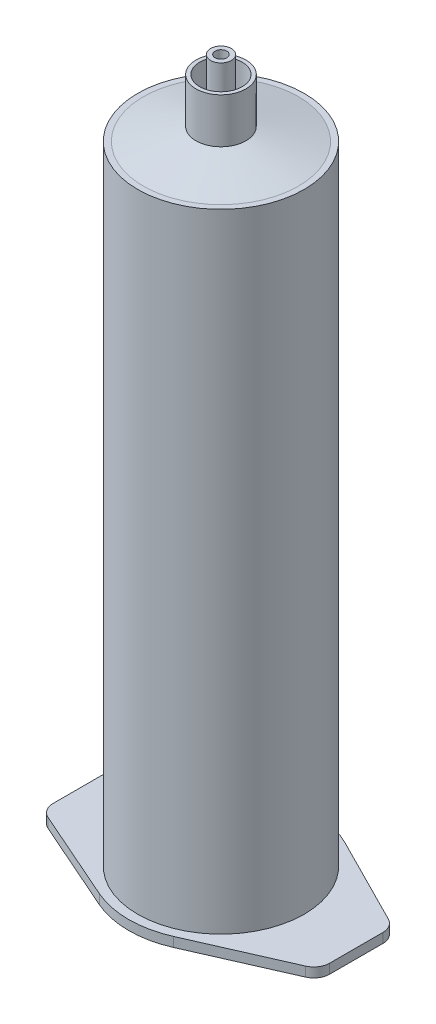
ISO-10303-21;
HEADER;
FILE_DESCRIPTION(('STEP AP214'),'2;1');
FILE_NAME('part.step','',(''),(''),'','','');
FILE_SCHEMA(('AUTOMOTIVE_DESIGN { 1 0 10303 214 1 1 1 1 }'));
ENDSEC;
DATA;
#1=APPLICATION_CONTEXT('core data for automotive mechanical design processes');
#2=APPLICATION_PROTOCOL_DEFINITION('international standard','automotive_design',2000,#1);
#3=PRODUCT_CONTEXT('',#1,'mechanical');
#4=PRODUCT('Part','Part','',(#3));
#5=PRODUCT_RELATED_PRODUCT_CATEGORY('part','',(#4));
#6=PRODUCT_DEFINITION_FORMATION('','',#4);
#7=PRODUCT_DEFINITION_CONTEXT('part definition',#1,'design');
#8=PRODUCT_DEFINITION('design','',#6,#7);
#9=PRODUCT_DEFINITION_SHAPE('','',#8);
#10=(LENGTH_UNIT() NAMED_UNIT(*) SI_UNIT(.MILLI.,.METRE.));
#11=(NAMED_UNIT(*) PLANE_ANGLE_UNIT() SI_UNIT($,.RADIAN.));
#12=(NAMED_UNIT(*) SI_UNIT($,.STERADIAN.) SOLID_ANGLE_UNIT());
#13=UNCERTAINTY_MEASURE_WITH_UNIT(LENGTH_MEASURE(1.E-05),#10,'distance_accuracy_value','');
#14=(GEOMETRIC_REPRESENTATION_CONTEXT(3) GLOBAL_UNCERTAINTY_ASSIGNED_CONTEXT((#13)) GLOBAL_UNIT_ASSIGNED_CONTEXT((#10,
#11,#12)) REPRESENTATION_CONTEXT('',''));
#15=CARTESIAN_POINT('',(0.,0.,0.));
#16=DIRECTION('',(0.,0.,1.));
#17=DIRECTION('',(1.,0.,0.));
#18=AXIS2_PLACEMENT_3D('',#15,#16,#17);
#19=CARTESIAN_POINT('',(-26.,-1.8,0.));
#20=DIRECTION('',(1.,0.,0.));
#21=DIRECTION('',(0.,0.,-1.));
#22=AXIS2_PLACEMENT_3D('',#19,#20,#21);
#23=PLANE('',#22);
#24=DIRECTION('',(0.,0.,-1.));
#25=VECTOR('',#24,1.);
#26=CARTESIAN_POINT('',(-26.,0.,0.));
#27=LINE('',#26,#25);
#28=CARTESIAN_POINT('',(-26.,0.,5.5523228190701));
#29=VERTEX_POINT('',#28);
#30=CARTESIAN_POINT('',(-26.,0.,-4.44630064282572));
#31=VERTEX_POINT('',#30);
#32=EDGE_CURVE('E177',#29,#31,#27,.T.);
#33=ORIENTED_EDGE('',*,*,#32,.T.);
#34=DIRECTION('',(0.,1.,0.));
#35=VECTOR('',#34,1.);
#36=CARTESIAN_POINT('',(-26.,-1.8,-4.44630064282572));
#37=LINE('',#36,#35);
#38=CARTESIAN_POINT('',(-26.,-1.8,-4.44630064282572));
#39=VERTEX_POINT('',#38);
#40=EDGE_CURVE('E13',#39,#31,#37,.T.);
#41=ORIENTED_EDGE('',*,*,#40,.F.);
#42=DIRECTION('',(0.,0.,-1.));
#43=VECTOR('',#42,1.);
#44=CARTESIAN_POINT('',(-26.,-1.8,0.));
#45=LINE('',#44,#43);
#46=CARTESIAN_POINT('',(-26.,-1.8,5.5523228190701));
#47=VERTEX_POINT('',#46);
#48=EDGE_CURVE('E425',#47,#39,#45,.T.);
#49=ORIENTED_EDGE('',*,*,#48,.F.);
#50=DIRECTION('',(0.,1.,0.));
#51=VECTOR('',#50,1.);
#52=CARTESIAN_POINT('',(-26.,-1.8,5.5523228190701));
#53=LINE('',#52,#51);
#54=EDGE_CURVE('E67',#47,#29,#53,.T.);
#55=ORIENTED_EDGE('',*,*,#54,.T.);
#56=EDGE_LOOP('',(#33,#41,#49,#55));
#57=FACE_BOUND('',#56,.T.);
#58=ADVANCED_FACE('F50',(#57),#23,.F.);
#59=CARTESIAN_POINT('',(-23.,-1.8,-4.44630064282574));
#60=DIRECTION('',(0.,1.,0.));
#61=DIRECTION('',(0.,0.,1.));
#62=AXIS2_PLACEMENT_3D('',#59,#60,#61);
#63=CYLINDRICAL_SURFACE('',#62,3.);
#64=CARTESIAN_POINT('',(-23.,0.,-4.44630064282574));
#65=DIRECTION('',(0.,-1.,0.));
#66=DIRECTION('',(0.,0.,-1.));
#67=AXIS2_PLACEMENT_3D('',#64,#65,#66);
#68=CIRCLE('',#67,3.);
#69=CARTESIAN_POINT('',(-24.3542389470097,0.,-7.1232460801483));
#70=VERTEX_POINT('',#69);
#71=EDGE_CURVE('E179',#31,#70,#68,.T.);
#72=ORIENTED_EDGE('',*,*,#71,.T.);
#73=DIRECTION('',(0.,1.,0.));
#74=VECTOR('',#73,1.);
#75=CARTESIAN_POINT('',(-24.3542389470097,-1.8,-7.1232460801483));
#76=LINE('',#75,#74);
#77=CARTESIAN_POINT('',(-24.3542389470097,-1.8,-7.1232460801483));
#78=VERTEX_POINT('',#77);
#79=EDGE_CURVE('E59',#78,#70,#76,.T.);
#80=ORIENTED_EDGE('',*,*,#79,.F.);
#81=CARTESIAN_POINT('',(-23.,-1.8,-4.44630064282574));
#82=DIRECTION('',(0.,-1.,0.));
#83=DIRECTION('',(0.,0.,-1.));
#84=AXIS2_PLACEMENT_3D('',#81,#82,#83);
#85=CIRCLE('',#84,3.);
#86=EDGE_CURVE('E117',#39,#78,#85,.T.);
#87=ORIENTED_EDGE('',*,*,#86,.F.);
#88=ORIENTED_EDGE('',*,*,#40,.T.);
#89=EDGE_LOOP('',(#72,#80,#87,#88));
#90=FACE_BOUND('',#89,.T.);
#91=ADVANCED_FACE('F272',(#90),#63,.T.);
#92=CARTESIAN_POINT('',(-7.83201524353949,-1.8,-15.4816677791821));
#93=DIRECTION('',(0.45141298233657,0.,0.892315145774184));
#94=DIRECTION('',(0.892315145774184,0.,-0.45141298233657));
#95=AXIS2_PLACEMENT_3D('',#92,#93,#94);
#96=PLANE('',#95);
#97=DIRECTION('',(0.892315145774184,0.,-0.45141298233657));
#98=VECTOR('',#97,1.);
#99=CARTESIAN_POINT('',(-7.83201524353949,0.,-15.4816677791821));
#100=LINE('',#99,#98);
#101=CARTESIAN_POINT('',(-7.83201524353949,0.,-15.4816677791821));
#102=VERTEX_POINT('',#101);
#103=EDGE_CURVE('E181',#70,#102,#100,.T.);
#104=ORIENTED_EDGE('',*,*,#103,.T.);
#105=DIRECTION('',(0.,1.,0.));
#106=VECTOR('',#105,1.);
#107=CARTESIAN_POINT('',(-7.83201524353949,-1.8,-15.4816677791821));
#108=LINE('',#107,#106);
#109=CARTESIAN_POINT('',(-7.83201524353949,-1.8,-15.4816677791821));
#110=VERTEX_POINT('',#109);
#111=EDGE_CURVE('E219',#110,#102,#108,.T.);
#112=ORIENTED_EDGE('',*,*,#111,.F.);
#113=DIRECTION('',(0.892315145774184,0.,-0.45141298233657));
#114=VECTOR('',#113,1.);
#115=CARTESIAN_POINT('',(-7.83201524353949,-1.8,-15.4816677791821));
#116=LINE('',#115,#114);
#117=EDGE_CURVE('E227',#78,#110,#116,.T.);
#118=ORIENTED_EDGE('',*,*,#117,.F.);
#119=ORIENTED_EDGE('',*,*,#79,.T.);
#120=EDGE_LOOP('',(#104,#112,#118,#119));
#121=FACE_BOUND('',#120,.T.);
#122=ADVANCED_FACE('F225',(#121),#96,.F.);
#123=CARTESIAN_POINT('',(0.,-1.8,0.));
#124=DIRECTION('',(0.,1.,0.));
#125=DIRECTION('',(0.,0.,1.));
#126=AXIS2_PLACEMENT_3D('',#123,#124,#125);
#127=CYLINDRICAL_SURFACE('',#126,17.35);
#128=CARTESIAN_POINT('',(0.,0.,0.));
#129=DIRECTION('',(0.,-1.,0.));
#130=DIRECTION('',(0.,0.,-1.));
#131=AXIS2_PLACEMENT_3D('',#128,#129,#130);
#132=CIRCLE('',#131,17.35);
#133=CARTESIAN_POINT('',(7.83201524353949,0.,-15.4816677791821));
#134=VERTEX_POINT('',#133);
#135=EDGE_CURVE('E183',#102,#134,#132,.T.);
#136=ORIENTED_EDGE('',*,*,#135,.T.);
#137=DIRECTION('',(0.,1.,0.));
#138=VECTOR('',#137,1.);
#139=CARTESIAN_POINT('',(7.83201524353949,-1.8,-15.4816677791821));
#140=LINE('',#139,#138);
#141=CARTESIAN_POINT('',(7.83201524353949,-1.8,-15.4816677791821));
#142=VERTEX_POINT('',#141);
#143=EDGE_CURVE('E217',#142,#134,#140,.T.);
#144=ORIENTED_EDGE('',*,*,#143,.F.);
#145=CARTESIAN_POINT('',(0.,-1.8,0.));
#146=DIRECTION('',(0.,-1.,0.));
#147=DIRECTION('',(0.,0.,-1.));
#148=AXIS2_PLACEMENT_3D('',#145,#146,#147);
#149=CIRCLE('',#148,17.35);
#150=EDGE_CURVE('E157',#110,#142,#149,.T.);
#151=ORIENTED_EDGE('',*,*,#150,.F.);
#152=ORIENTED_EDGE('',*,*,#111,.T.);
#153=EDGE_LOOP('',(#136,#144,#151,#152));
#154=FACE_BOUND('',#153,.T.);
#155=ADVANCED_FACE('F234',(#154),#127,.T.);
#156=CARTESIAN_POINT('',(7.83201524353949,-1.8,-15.4816677791821));
#157=DIRECTION('',(0.45141298233657,0.,-0.892315145774184));
#158=DIRECTION('',(-0.892315145774184,0.,-0.45141298233657));
#159=AXIS2_PLACEMENT_3D('',#156,#157,#158);
#160=PLANE('',#159);
#161=DIRECTION('',(-0.892315145774184,0.,-0.45141298233657));
#162=VECTOR('',#161,1.);
#163=CARTESIAN_POINT('',(7.83201524353949,0.,-15.4816677791821));
#164=LINE('',#163,#162);
#165=CARTESIAN_POINT('',(24.3542389470097,0.,-7.1232460801483));
#166=VERTEX_POINT('',#165);
#167=EDGE_CURVE('E186',#166,#134,#164,.T.);
#168=ORIENTED_EDGE('',*,*,#167,.F.);
#169=DIRECTION('',(0.,1.,0.));
#170=VECTOR('',#169,1.);
#171=CARTESIAN_POINT('',(24.3542389470097,-1.8,-7.1232460801483));
#172=LINE('',#171,#170);
#173=CARTESIAN_POINT('',(24.3542389470097,-1.8,-7.1232460801483));
#174=VERTEX_POINT('',#173);
#175=EDGE_CURVE('E215',#174,#166,#172,.T.);
#176=ORIENTED_EDGE('',*,*,#175,.F.);
#177=DIRECTION('',(-0.892315145774184,0.,-0.45141298233657));
#178=VECTOR('',#177,1.);
#179=CARTESIAN_POINT('',(7.83201524353949,-1.8,-15.4816677791821));
#180=LINE('',#179,#178);
#181=EDGE_CURVE('E238',#174,#142,#180,.T.);
#182=ORIENTED_EDGE('',*,*,#181,.T.);
#183=ORIENTED_EDGE('',*,*,#143,.T.);
#184=EDGE_LOOP('',(#168,#176,#182,#183));
#185=FACE_BOUND('',#184,.T.);
#186=ADVANCED_FACE('F280',(#185),#160,.T.);
#187=CARTESIAN_POINT('',(23.,-1.8,-4.44630064282574));
#188=DIRECTION('',(0.,1.,0.));
#189=DIRECTION('',(0.,0.,1.));
#190=AXIS2_PLACEMENT_3D('',#187,#188,#189);
#191=CYLINDRICAL_SURFACE('',#190,3.);
#192=CARTESIAN_POINT('',(23.,0.,-4.44630064282574));
#193=DIRECTION('',(0.,-1.,0.));
#194=DIRECTION('',(0.,0.,-1.));
#195=AXIS2_PLACEMENT_3D('',#192,#193,#194);
#196=CIRCLE('',#195,3.);
#197=CARTESIAN_POINT('',(26.,0.,-4.44630064282572));
#198=VERTEX_POINT('',#197);
#199=EDGE_CURVE('E189',#198,#166,#196,.F.);
#200=ORIENTED_EDGE('',*,*,#199,.F.);
#201=DIRECTION('',(0.,1.,0.));
#202=VECTOR('',#201,1.);
#203=CARTESIAN_POINT('',(26.,-1.8,-4.44630064282572));
#204=LINE('',#203,#202);
#205=CARTESIAN_POINT('',(26.,-1.8,-4.44630064282572));
#206=VERTEX_POINT('',#205);
#207=EDGE_CURVE('E213',#206,#198,#204,.T.);
#208=ORIENTED_EDGE('',*,*,#207,.F.);
#209=CARTESIAN_POINT('',(23.,-1.8,-4.44630064282574));
#210=DIRECTION('',(0.,-1.,0.));
#211=DIRECTION('',(0.,0.,-1.));
#212=AXIS2_PLACEMENT_3D('',#209,#210,#211);
#213=CIRCLE('',#212,3.);
#214=EDGE_CURVE('E239',#206,#174,#213,.F.);
#215=ORIENTED_EDGE('',*,*,#214,.T.);
#216=ORIENTED_EDGE('',*,*,#175,.T.);
#217=EDGE_LOOP('',(#200,#208,#215,#216));
#218=FACE_BOUND('',#217,.T.);
#219=ADVANCED_FACE('F283',(#218),#191,.T.);
#220=CARTESIAN_POINT('',(26.,-1.8,0.));
#221=DIRECTION('',(1.,0.,0.));
#222=DIRECTION('',(0.,0.,-1.));
#223=AXIS2_PLACEMENT_3D('',#220,#221,#222);
#224=PLANE('',#223);
#225=DIRECTION('',(0.,0.,-1.));
#226=VECTOR('',#225,1.);
#227=CARTESIAN_POINT('',(26.,0.,0.));
#228=LINE('',#227,#226);
#229=CARTESIAN_POINT('',(26.,0.,5.5523228190701));
#230=VERTEX_POINT('',#229);
#231=EDGE_CURVE('E192',#230,#198,#228,.T.);
#232=ORIENTED_EDGE('',*,*,#231,.F.);
#233=DIRECTION('',(0.,1.,0.));
#234=VECTOR('',#233,1.);
#235=CARTESIAN_POINT('',(26.,-1.8,5.5523228190701));
#236=LINE('',#235,#234);
#237=CARTESIAN_POINT('',(26.,-1.8,5.5523228190701));
#238=VERTEX_POINT('',#237);
#239=EDGE_CURVE('E211',#238,#230,#236,.T.);
#240=ORIENTED_EDGE('',*,*,#239,.F.);
#241=DIRECTION('',(0.,0.,-1.));
#242=VECTOR('',#241,1.);
#243=CARTESIAN_POINT('',(26.,-1.8,0.));
#244=LINE('',#243,#242);
#245=EDGE_CURVE('E246',#238,#206,#244,.T.);
#246=ORIENTED_EDGE('',*,*,#245,.T.);
#247=ORIENTED_EDGE('',*,*,#207,.T.);
#248=EDGE_LOOP('',(#232,#240,#246,#247));
#249=FACE_BOUND('',#248,.T.);
#250=ADVANCED_FACE('F287',(#249),#224,.T.);
#251=CARTESIAN_POINT('',(23.,-1.8,5.55232281907011));
#252=DIRECTION('',(0.,1.,0.));
#253=DIRECTION('',(0.,0.,1.));
#254=AXIS2_PLACEMENT_3D('',#251,#252,#253);
#255=CYLINDRICAL_SURFACE('',#254,3.);
#256=CARTESIAN_POINT('',(23.,0.,5.55232281907011));
#257=DIRECTION('',(0.,-1.,0.));
#258=DIRECTION('',(0.,0.,-1.));
#259=AXIS2_PLACEMENT_3D('',#256,#257,#258);
#260=CIRCLE('',#259,3.);
#261=CARTESIAN_POINT('',(24.2089291094169,0.,8.29795396844258));
#262=VERTEX_POINT('',#261);
#263=EDGE_CURVE('E195',#230,#262,#260,.T.);
#264=ORIENTED_EDGE('',*,*,#263,.T.);
#265=DIRECTION('',(0.,1.,0.));
#266=VECTOR('',#265,1.);
#267=CARTESIAN_POINT('',(24.2089291094169,-1.8,8.29795396844258));
#268=LINE('',#267,#266);
#269=CARTESIAN_POINT('',(24.2089291094169,-1.8,8.29795396844258));
#270=VERTEX_POINT('',#269);
#271=EDGE_CURVE('E208',#270,#262,#268,.T.);
#272=ORIENTED_EDGE('',*,*,#271,.F.);
#273=CARTESIAN_POINT('',(23.,-1.8,5.55232281907011));
#274=DIRECTION('',(0.,-1.,0.));
#275=DIRECTION('',(0.,0.,-1.));
#276=AXIS2_PLACEMENT_3D('',#273,#274,#275);
#277=CIRCLE('',#276,3.);
#278=EDGE_CURVE('E248',#238,#270,#277,.T.);
#279=ORIENTED_EDGE('',*,*,#278,.F.);
#280=ORIENTED_EDGE('',*,*,#239,.T.);
#281=EDGE_LOOP('',(#264,#272,#279,#280));
#282=FACE_BOUND('',#281,.T.);
#283=ADVANCED_FACE('F254',(#282),#255,.T.);
#284=CARTESIAN_POINT('',(6.99164001612796,-1.8,15.8789001472041));
#285=DIRECTION('',(-0.402976369805646,0.,-0.915210383124155));
#286=DIRECTION('',(-0.915210383124156,0.,0.402976369805646));
#287=AXIS2_PLACEMENT_3D('',#284,#285,#286);
#288=PLANE('',#287);
#289=DIRECTION('',(-0.915210383124156,0.,0.402976369805646));
#290=VECTOR('',#289,1.);
#291=CARTESIAN_POINT('',(6.99164001612796,0.,15.8789001472041));
#292=LINE('',#291,#290);
#293=CARTESIAN_POINT('',(6.99164001612796,0.,15.8789001472041));
#294=VERTEX_POINT('',#293);
#295=EDGE_CURVE('E197',#262,#294,#292,.T.);
#296=ORIENTED_EDGE('',*,*,#295,.T.);
#297=DIRECTION('',(0.,1.,0.));
#298=VECTOR('',#297,1.);
#299=CARTESIAN_POINT('',(6.99164001612796,-1.8,15.8789001472041));
#300=LINE('',#299,#298);
#301=CARTESIAN_POINT('',(6.99164001612796,-1.8,15.8789001472041));
#302=VERTEX_POINT('',#301);
#303=EDGE_CURVE('E165',#302,#294,#300,.T.);
#304=ORIENTED_EDGE('',*,*,#303,.F.);
#305=DIRECTION('',(-0.915210383124156,0.,0.402976369805646));
#306=VECTOR('',#305,1.);
#307=CARTESIAN_POINT('',(6.99164001612796,-1.8,15.8789001472041));
#308=LINE('',#307,#306);
#309=EDGE_CURVE('E152',#270,#302,#308,.T.);
#310=ORIENTED_EDGE('',*,*,#309,.F.);
#311=ORIENTED_EDGE('',*,*,#271,.T.);
#312=EDGE_LOOP('',(#296,#304,#310,#311));
#313=FACE_BOUND('',#312,.T.);
#314=ADVANCED_FACE('F258',(#313),#288,.F.);
#315=CARTESIAN_POINT('',(-6.99164001612796,0.,15.8789001472041));
#316=VERTEX_POINT('',#315);
#317=EDGE_CURVE('E162',#294,#316,#132,.T.);
#318=ORIENTED_EDGE('',*,*,#317,.T.);
#319=DIRECTION('',(0.,1.,0.));
#320=VECTOR('',#319,1.);
#321=CARTESIAN_POINT('',(-6.99164001612796,-1.8,15.8789001472041));
#322=LINE('',#321,#320);
#323=CARTESIAN_POINT('',(-6.99164001612796,-1.8,15.8789001472041));
#324=VERTEX_POINT('',#323);
#325=EDGE_CURVE('E159',#324,#316,#322,.T.);
#326=ORIENTED_EDGE('',*,*,#325,.F.);
#327=EDGE_CURVE('E145',#302,#324,#149,.T.);
#328=ORIENTED_EDGE('',*,*,#327,.F.);
#329=ORIENTED_EDGE('',*,*,#303,.T.);
#330=EDGE_LOOP('',(#318,#326,#328,#329));
#331=FACE_BOUND('',#330,.T.);
#332=ADVANCED_FACE('F160',(#331),#127,.T.);
#333=CARTESIAN_POINT('',(-6.99164001612796,-1.8,15.8789001472041));
#334=DIRECTION('',(-0.402976369805646,0.,0.915210383124155));
#335=DIRECTION('',(0.915210383124156,0.,0.402976369805646));
#336=AXIS2_PLACEMENT_3D('',#333,#334,#335);
#337=PLANE('',#336);
#338=DIRECTION('',(0.915210383124156,0.,0.402976369805646));
#339=VECTOR('',#338,1.);
#340=CARTESIAN_POINT('',(-6.99164001612796,0.,15.8789001472041));
#341=LINE('',#340,#339);
#342=CARTESIAN_POINT('',(-24.2089291094169,0.,8.29795396844258));
#343=VERTEX_POINT('',#342);
#344=EDGE_CURVE('E199',#343,#316,#341,.T.);
#345=ORIENTED_EDGE('',*,*,#344,.F.);
#346=DIRECTION('',(0.,1.,0.));
#347=VECTOR('',#346,1.);
#348=CARTESIAN_POINT('',(-24.2089291094169,-1.8,8.29795396844258));
#349=LINE('',#348,#347);
#350=CARTESIAN_POINT('',(-24.2089291094169,-1.8,8.29795396844258));
#351=VERTEX_POINT('',#350);
#352=EDGE_CURVE('E105',#351,#343,#349,.T.);
#353=ORIENTED_EDGE('',*,*,#352,.F.);
#354=DIRECTION('',(0.915210383124156,0.,0.402976369805646));
#355=VECTOR('',#354,1.);
#356=CARTESIAN_POINT('',(-6.99164001612796,-1.8,15.8789001472041));
#357=LINE('',#356,#355);
#358=EDGE_CURVE('E150',#351,#324,#357,.T.);
#359=ORIENTED_EDGE('',*,*,#358,.T.);
#360=ORIENTED_EDGE('',*,*,#325,.T.);
#361=EDGE_LOOP('',(#345,#353,#359,#360));
#362=FACE_BOUND('',#361,.T.);
#363=ADVANCED_FACE('F167',(#362),#337,.T.);
#364=CARTESIAN_POINT('',(0.,-1.8,0.));
#365=DIRECTION('',(0.,1.,0.));
#366=DIRECTION('',(0.,0.,1.));
#367=AXIS2_PLACEMENT_3D('',#364,#365,#366);
#368=CYLINDRICAL_SURFACE('',#367,14.575);
#369=CARTESIAN_POINT('',(0.,-1.8,0.));
#370=DIRECTION('',(0.,-1.,0.));
#371=DIRECTION('',(0.,0.,-1.));
#372=AXIS2_PLACEMENT_3D('',#369,#370,#371);
#373=CIRCLE('',#372,14.575);
#374=CARTESIAN_POINT('',(0.,-1.8,-14.575));
#375=VERTEX_POINT('',#374);
#376=EDGE_CURVE('E204',#375,#375,#373,.F.);
#377=ORIENTED_EDGE('',*,*,#376,.F.);
#378=EDGE_LOOP('',(#377));
#379=FACE_BOUND('',#378,.T.);
#380=CARTESIAN_POINT('',(0.,0.,0.));
#381=DIRECTION('',(0.,-1.,0.));
#382=DIRECTION('',(0.,0.,-1.));
#383=AXIS2_PLACEMENT_3D('',#380,#381,#382);
#384=CIRCLE('',#383,14.575);
#385=CARTESIAN_POINT('',(0.,0.,-14.575));
#386=VERTEX_POINT('',#385);
#387=EDGE_CURVE('E174',#386,#386,#384,.F.);
#388=ORIENTED_EDGE('',*,*,#387,.T.);
#389=EDGE_LOOP('',(#388));
#390=FACE_BOUND('',#389,.T.);
#391=ADVANCED_FACE('F52',(#379,#390),#368,.F.);
#392=CARTESIAN_POINT('',(-23.,-1.8,5.55232281907011));
#393=DIRECTION('',(0.,1.,0.));
#394=DIRECTION('',(0.,0.,1.));
#395=AXIS2_PLACEMENT_3D('',#392,#393,#394);
#396=CYLINDRICAL_SURFACE('',#395,3.);
#397=CARTESIAN_POINT('',(-23.,0.,5.55232281907011));
#398=DIRECTION('',(0.,-1.,0.));
#399=DIRECTION('',(0.,0.,-1.));
#400=AXIS2_PLACEMENT_3D('',#397,#398,#399);
#401=CIRCLE('',#400,3.);
#402=EDGE_CURVE('E201',#29,#343,#401,.F.);
#403=ORIENTED_EDGE('',*,*,#402,.F.);
#404=ORIENTED_EDGE('',*,*,#54,.F.);
#405=CARTESIAN_POINT('',(-23.,-1.8,5.55232281907011));
#406=DIRECTION('',(0.,-1.,0.));
#407=DIRECTION('',(0.,0.,-1.));
#408=AXIS2_PLACEMENT_3D('',#405,#406,#407);
#409=CIRCLE('',#408,3.);
#410=EDGE_CURVE('E168',#47,#351,#409,.F.);
#411=ORIENTED_EDGE('',*,*,#410,.T.);
#412=ORIENTED_EDGE('',*,*,#352,.T.);
#413=EDGE_LOOP('',(#403,#404,#411,#412));
#414=FACE_BOUND('',#413,.T.);
#415=ADVANCED_FACE('F259',(#414),#396,.T.);
#416=CARTESIAN_POINT('',(0.,-1.8,0.));
#417=DIRECTION('',(0.,-1.,0.));
#418=DIRECTION('',(0.,0.,-1.));
#419=AXIS2_PLACEMENT_3D('',#416,#417,#418);
#420=PLANE('',#419);
#421=ORIENTED_EDGE('',*,*,#376,.T.);
#422=EDGE_LOOP('',(#421));
#423=FACE_BOUND('',#422,.T.);
#424=ORIENTED_EDGE('',*,*,#48,.T.);
#425=ORIENTED_EDGE('',*,*,#86,.T.);
#426=ORIENTED_EDGE('',*,*,#117,.T.);
#427=ORIENTED_EDGE('',*,*,#150,.T.);
#428=ORIENTED_EDGE('',*,*,#181,.F.);
#429=ORIENTED_EDGE('',*,*,#214,.F.);
#430=ORIENTED_EDGE('',*,*,#245,.F.);
#431=ORIENTED_EDGE('',*,*,#278,.T.);
#432=ORIENTED_EDGE('',*,*,#309,.T.);
#433=ORIENTED_EDGE('',*,*,#327,.T.);
#434=ORIENTED_EDGE('',*,*,#358,.F.);
#435=ORIENTED_EDGE('',*,*,#410,.F.);
#436=EDGE_LOOP('',(#424,#425,#426,#427,#428,#429,#430,#431,#432,#433,#434,#435));
#437=FACE_BOUND('',#436,.T.);
#438=ADVANCED_FACE('F147',(#423,#437),#420,.T.);
#439=CARTESIAN_POINT('',(0.,0.,0.));
#440=DIRECTION('',(0.,-1.,0.));
#441=DIRECTION('',(0.,0.,-1.));
#442=AXIS2_PLACEMENT_3D('',#439,#440,#441);
#443=PLANE('',#442);
#444=ORIENTED_EDGE('',*,*,#387,.F.);
#445=EDGE_LOOP('',(#444));
#446=FACE_BOUND('',#445,.T.);
#447=ORIENTED_EDGE('',*,*,#32,.F.);
#448=ORIENTED_EDGE('',*,*,#402,.T.);
#449=ORIENTED_EDGE('',*,*,#344,.T.);
#450=ORIENTED_EDGE('',*,*,#317,.F.);
#451=ORIENTED_EDGE('',*,*,#295,.F.);
#452=ORIENTED_EDGE('',*,*,#263,.F.);
#453=ORIENTED_EDGE('',*,*,#231,.T.);
#454=ORIENTED_EDGE('',*,*,#199,.T.);
#455=ORIENTED_EDGE('',*,*,#167,.T.);
#456=ORIENTED_EDGE('',*,*,#135,.F.);
#457=ORIENTED_EDGE('',*,*,#103,.F.);
#458=ORIENTED_EDGE('',*,*,#71,.F.);
#459=EDGE_LOOP('',(#447,#448,#449,#450,#451,#452,#453,#454,#455,#456,#457,#458));
#460=FACE_BOUND('',#459,.T.);
#461=ADVANCED_FACE('F230',(#446,#460),#443,.F.);
#462=CLOSED_SHELL('',(#58,#91,#122,#155,#186,#219,#250,#283,#314,#332,#363,#391,#415,#438,#461));
#463=MANIFOLD_SOLID_BREP('B2',#462);
#464=CARTESIAN_POINT('',(0.,121.6,0.));
#465=DIRECTION('',(0.,-1.,0.));
#466=DIRECTION('',(0.,0.,-1.));
#467=AXIS2_PLACEMENT_3D('',#464,#465,#466);
#468=CONICAL_SURFACE('',#467,0.,1.32864479668516);
#469=CARTESIAN_POINT('',(0.,118.,0.));
#470=DIRECTION('',(0.,1.,0.));
#471=DIRECTION('',(0.,0.,1.));
#472=AXIS2_PLACEMENT_3D('',#469,#470,#471);
#473=CIRCLE('',#472,14.575);
#474=CARTESIAN_POINT('',(0.,118.,-14.575));
#475=VERTEX_POINT('',#474);
#476=EDGE_CURVE('E448',#475,#475,#473,.T.);
#477=CARTESIAN_POINT('',(0.,120.43910806175,0.));
#478=DIRECTION('',(0.,-1.,0.));
#479=DIRECTION('',(0.,0.,-1.));
#480=AXIS2_PLACEMENT_3D('',#477,#478,#479);
#481=CIRCLE('',#480,4.7);
#482=CARTESIAN_POINT('',(0.,120.43910806175,-4.69999999999998));
#483=VERTEX_POINT('',#482);
#484=EDGE_CURVE('E49',#483,#483,#481,.F.);
#485=CARTESIAN_POINT('',(0.,118.,-14.575));
#486=CARTESIAN_POINT('',(0.,118.025407375643,-14.4721354166667));
#487=CARTESIAN_POINT('',(0.,118.050814751286,-14.3692708333334));
#488=CARTESIAN_POINT('',(0.,118.101629502573,-14.1635416666667));
#489=CARTESIAN_POINT('',(0.,118.127036878216,-14.0606770833334));
#490=CARTESIAN_POINT('',(0.,118.177851629503,-13.8549479166667));
#491=CARTESIAN_POINT('',(0.,118.203259005146,-13.7520833333334));
#492=CARTESIAN_POINT('',(0.,118.254073756432,-13.5463541666667));
#493=CARTESIAN_POINT('',(0.,118.279481132075,-13.4434895833334));
#494=CARTESIAN_POINT('',(0.,118.330295883362,-13.2377604166667));
#495=CARTESIAN_POINT('',(0.,118.355703259005,-13.1348958333334));
#496=CARTESIAN_POINT('',(0.,118.406518010292,-12.9291666666667));
#497=CARTESIAN_POINT('',(0.,118.431925385935,-12.8263020833334));
#498=CARTESIAN_POINT('',(0.,118.482740137221,-12.6205729166667));
#499=CARTESIAN_POINT('',(0.,118.508147512864,-12.5177083333334));
#500=CARTESIAN_POINT('',(0.,118.558962264151,-12.3119791666667));
#501=CARTESIAN_POINT('',(0.,118.584369639794,-12.2091145833334));
#502=CARTESIAN_POINT('',(0.,118.635184391081,-12.0033854166667));
#503=CARTESIAN_POINT('',(0.,118.660591766724,-11.9005208333334));
#504=CARTESIAN_POINT('',(0.,118.71140651801,-11.6947916666667));
#505=CARTESIAN_POINT('',(0.,118.736813893654,-11.5919270833334));
#506=CARTESIAN_POINT('',(0.,118.78762864494,-11.3861979166667));
#507=CARTESIAN_POINT('',(0.,118.813036020583,-11.2833333333333));
#508=CARTESIAN_POINT('',(0.,118.86385077187,-11.0776041666667));
#509=CARTESIAN_POINT('',(0.,118.889258147513,-10.9747395833333));
#510=CARTESIAN_POINT('',(0.,118.940072898799,-10.7690104166667));
#511=CARTESIAN_POINT('',(0.,118.965480274443,-10.6661458333333));
#512=CARTESIAN_POINT('',(0.,119.016295025729,-10.4604166666667));
#513=CARTESIAN_POINT('',(0.,119.041702401372,-10.3575520833333));
#514=CARTESIAN_POINT('',(0.,119.092517152659,-10.1518229166667));
#515=CARTESIAN_POINT('',(0.,119.117924528302,-10.0489583333333));
#516=CARTESIAN_POINT('',(0.,119.168739279588,-9.84322916666667));
#517=CARTESIAN_POINT('',(0.,119.194146655232,-9.74036458333334));
#518=CARTESIAN_POINT('',(0.,119.244961406518,-9.53463541666667));
#519=CARTESIAN_POINT('',(0.,119.270368782161,-9.43177083333334));
#520=CARTESIAN_POINT('',(0.,119.321183533448,-9.22604166666667));
#521=CARTESIAN_POINT('',(0.,119.346590909091,-9.12317708333334));
#522=CARTESIAN_POINT('',(0.,119.397405660377,-8.91744791666667));
#523=CARTESIAN_POINT('',(0.,119.422813036021,-8.81458333333333));
#524=CARTESIAN_POINT('',(0.,119.473627787307,-8.60885416666667));
#525=CARTESIAN_POINT('',(0.,119.49903516295,-8.50598958333333));
#526=CARTESIAN_POINT('',(0.,119.549849914237,-8.30026041666667));
#527=CARTESIAN_POINT('',(0.,119.57525728988,-8.19739583333333));
#528=CARTESIAN_POINT('',(0.,119.626072041166,-7.99166666666667));
#529=CARTESIAN_POINT('',(0.,119.65147941681,-7.88880208333333));
#530=CARTESIAN_POINT('',(0.,119.702294168096,-7.68307291666666));
#531=CARTESIAN_POINT('',(0.,119.727701543739,-7.58020833333333));
#532=CARTESIAN_POINT('',(0.,119.778516295026,-7.37447916666666));
#533=CARTESIAN_POINT('',(0.,119.803923670669,-7.27161458333333));
#534=CARTESIAN_POINT('',(0.,119.854738421955,-7.06588541666666));
#535=CARTESIAN_POINT('',(0.,119.880145797599,-6.96302083333333));
#536=CARTESIAN_POINT('',(0.,119.930960548885,-6.75729166666666));
#537=CARTESIAN_POINT('',(0.,119.956367924528,-6.65442708333333));
#538=CARTESIAN_POINT('',(0.,120.007182675815,-6.44869791666666));
#539=CARTESIAN_POINT('',(0.,120.032590051458,-6.34583333333332));
#540=CARTESIAN_POINT('',(0.,120.083404802744,-6.14010416666666));
#541=CARTESIAN_POINT('',(0.,120.108812178388,-6.03723958333332));
#542=CARTESIAN_POINT('',(0.,120.159626929674,-5.83151041666665));
#543=CARTESIAN_POINT('',(0.,120.185034305317,-5.72864583333332));
#544=CARTESIAN_POINT('',(0.,120.235849056604,-5.52291666666665));
#545=CARTESIAN_POINT('',(0.,120.261256432247,-5.42005208333332));
#546=CARTESIAN_POINT('',(0.,120.312071183533,-5.21432291666665));
#547=CARTESIAN_POINT('',(0.,120.337478559177,-5.11145833333332));
#548=CARTESIAN_POINT('',(0.,120.388293310463,-4.90572916666665));
#549=CARTESIAN_POINT('',(0.,120.413700686106,-4.80286458333332));
#550=CARTESIAN_POINT('',(0.,120.43910806175,-4.69999999999998));
#551=B_SPLINE_CURVE_WITH_KNOTS('',3,(#485,#486,#487,#488,#489,#490,#491,#492,#493,#494,#495,
#496,#497,#498,#499,#500,#501,#502,#503,#504,#505,#506,#507,#508,#509,#510,#511,#512,#513,#514,
#515,#516,#517,#518,#519,#520,#521,#522,#523,#524,#525,#526,#527,#528,#529,#530,#531,#532,#533,
#534,#535,#536,#537,#538,#539,#540,#541,#542,#543,#544,#545,#546,#547,#548,#549,#550),
.UNSPECIFIED.,.F.,.F.,(4,2,2,2,2,2,2,2,2,2,2,2,2,2,2,2,2,2,2,2,2,2,2,2,2,2,2,2,2,2,2,2,4),(0.,
0.317867763657697,0.635735527315396,0.953603290973096,1.27147105463079,1.58933881828849,
1.90720658194619,2.22507434560389,2.54294210926159,2.86080987291929,3.17867763657699,
3.49654540023469,3.81441316389239,4.13228092755009,4.45014869120779,4.76801645486549,
5.08588421852319,5.40375198218089,5.72161974583859,6.03948750949629,6.35735527315399,
6.67522303681169,6.99309080046938,7.31095856412708,7.62882632778478,7.94669409144248,
8.26456185510018,8.58242961875788,8.90029738241558,9.21816514607328,9.53603290973097,
9.85390067338867,10.1717684370464),.UNSPECIFIED.);
#552=EDGE_CURVE('BSEAM432',#475,#483,#551,.T.);
#553=ORIENTED_EDGE('',*,*,#476,.T.);
#554=ORIENTED_EDGE('',*,*,#484,.F.);
#555=ORIENTED_EDGE('',*,*,#552,.T.);
#556=ORIENTED_EDGE('',*,*,#552,.F.);
#557=EDGE_LOOP('',(#553,#555,#554,#556));
#558=FACE_BOUND('',#557,.T.);
#559=ADVANCED_FACE('F432',(#558),#468,.T.);
#560=CARTESIAN_POINT('',(0.,118.,0.));
#561=DIRECTION('',(0.,-1.,0.));
#562=DIRECTION('',(0.,0.,-1.));
#563=AXIS2_PLACEMENT_3D('',#560,#561,#562);
#564=CYLINDRICAL_SURFACE('',#563,14.575);
#565=CARTESIAN_POINT('',(0.,0.,0.));
#566=DIRECTION('',(0.,1.,0.));
#567=DIRECTION('',(0.,0.,1.));
#568=AXIS2_PLACEMENT_3D('',#565,#566,#567);
#569=CIRCLE('',#568,14.575);
#570=CARTESIAN_POINT('',(0.,0.,14.575));
#571=VERTEX_POINT('',#570);
#572=EDGE_CURVE('E450',#571,#571,#569,.T.);
#573=ORIENTED_EDGE('',*,*,#572,.F.);
#574=EDGE_LOOP('',(#573));
#575=FACE_BOUND('',#574,.T.);
#576=CARTESIAN_POINT('',(0.,116.92,0.));
#577=DIRECTION('',(0.,-1.,0.));
#578=DIRECTION('',(0.,0.,-1.));
#579=AXIS2_PLACEMENT_3D('',#576,#577,#578);
#580=CIRCLE('',#579,14.575);
#581=CARTESIAN_POINT('',(0.,116.92,-14.575));
#582=VERTEX_POINT('',#581);
#583=EDGE_CURVE('E453',#582,#582,#580,.T.);
#584=ORIENTED_EDGE('',*,*,#583,.F.);
#585=EDGE_LOOP('',(#584));
#586=FACE_BOUND('',#585,.T.);
#587=ADVANCED_FACE('F505',(#575,#586),#564,.F.);
#588=CARTESIAN_POINT('',(0.,118.,0.));
#589=DIRECTION('',(0.,1.,0.));
#590=DIRECTION('',(0.,0.,1.));
#591=AXIS2_PLACEMENT_3D('',#588,#589,#590);
#592=PLANE('',#591);
#593=CARTESIAN_POINT('',(0.,118.,0.));
#594=DIRECTION('',(0.,1.,0.));
#595=DIRECTION('',(0.,0.,1.));
#596=AXIS2_PLACEMENT_3D('',#593,#594,#595);
#597=CIRCLE('',#596,15.65);
#598=CARTESIAN_POINT('',(0.,118.,15.65));
#599=VERTEX_POINT('',#598);
#600=EDGE_CURVE('E439',#599,#599,#597,.T.);
#601=ORIENTED_EDGE('',*,*,#600,.T.);
#602=EDGE_LOOP('',(#601));
#603=FACE_BOUND('',#602,.T.);
#604=ORIENTED_EDGE('',*,*,#476,.F.);
#605=EDGE_LOOP('',(#604));
#606=FACE_BOUND('',#605,.T.);
#607=ADVANCED_FACE('F510',(#603,#606),#592,.T.);
#608=CARTESIAN_POINT('',(0.,0.,0.));
#609=DIRECTION('',(0.,1.,0.));
#610=DIRECTION('',(0.,0.,1.));
#611=AXIS2_PLACEMENT_3D('',#608,#609,#610);
#612=PLANE('',#611);
#613=CARTESIAN_POINT('',(0.,0.,0.));
#614=DIRECTION('',(0.,1.,0.));
#615=DIRECTION('',(0.,0.,1.));
#616=AXIS2_PLACEMENT_3D('',#613,#614,#615);
#617=CIRCLE('',#616,15.65);
#618=CARTESIAN_POINT('',(0.,0.,15.65));
#619=VERTEX_POINT('',#618);
#620=EDGE_CURVE('E443',#619,#619,#617,.T.);
#621=ORIENTED_EDGE('',*,*,#620,.F.);
#622=EDGE_LOOP('',(#621));
#623=FACE_BOUND('',#622,.T.);
#624=ORIENTED_EDGE('',*,*,#572,.T.);
#625=EDGE_LOOP('',(#624));
#626=FACE_BOUND('',#625,.T.);
#627=ADVANCED_FACE('F518',(#623,#626),#612,.F.);
#628=CARTESIAN_POINT('',(0.,118.,0.));
#629=DIRECTION('',(0.,-1.,0.));
#630=DIRECTION('',(0.,0.,-1.));
#631=AXIS2_PLACEMENT_3D('',#628,#629,#630);
#632=CYLINDRICAL_SURFACE('',#631,15.65);
#633=ORIENTED_EDGE('',*,*,#600,.F.);
#634=EDGE_LOOP('',(#633));
#635=FACE_BOUND('',#634,.T.);
#636=ORIENTED_EDGE('',*,*,#620,.T.);
#637=EDGE_LOOP('',(#636));
#638=FACE_BOUND('',#637,.T.);
#639=ADVANCED_FACE('F434',(#635,#638),#632,.T.);
#640=CARTESIAN_POINT('',(0.,116.92,0.));
#641=DIRECTION('',(0.,-1.,0.));
#642=DIRECTION('',(0.,0.,-1.));
#643=AXIS2_PLACEMENT_3D('',#640,#641,#642);
#644=CONICAL_SURFACE('',#643,14.575,1.32864479668516);
#645=CARTESIAN_POINT('',(0.,120.248301886792,0.));
#646=DIRECTION('',(0.,-1.,0.));
#647=DIRECTION('',(0.,0.,-1.));
#648=AXIS2_PLACEMENT_3D('',#645,#646,#647);
#649=CIRCLE('',#648,1.1);
#650=CARTESIAN_POINT('',(0.,120.248301886792,-1.1));
#651=VERTEX_POINT('',#650);
#652=EDGE_CURVE('E476',#651,#651,#649,.F.);
#653=CARTESIAN_POINT('',(0.,120.248301886792,-1.1));
#654=CARTESIAN_POINT('',(0.,120.213632075472,-1.24036458333333));
#655=CARTESIAN_POINT('',(0.,120.178962264151,-1.38072916666666));
#656=CARTESIAN_POINT('',(0.,120.109622641509,-1.66145833333333));
#657=CARTESIAN_POINT('',(0.,120.074952830189,-1.80182291666666));
#658=CARTESIAN_POINT('',(0.,120.005613207547,-2.08255208333333));
#659=CARTESIAN_POINT('',(0.,119.970943396226,-2.22291666666666));
#660=CARTESIAN_POINT('',(0.,119.901603773585,-2.50364583333333));
#661=CARTESIAN_POINT('',(0.,119.866933962264,-2.64401041666666));
#662=CARTESIAN_POINT('',(0.,119.797594339623,-2.92473958333333));
#663=CARTESIAN_POINT('',(0.,119.762924528302,-3.06510416666666));
#664=CARTESIAN_POINT('',(0.,119.69358490566,-3.34583333333333));
#665=CARTESIAN_POINT('',(0.,119.65891509434,-3.48619791666666));
#666=CARTESIAN_POINT('',(0.,119.589575471698,-3.76692708333333));
#667=CARTESIAN_POINT('',(0.,119.554905660377,-3.90729166666666));
#668=CARTESIAN_POINT('',(0.,119.485566037736,-4.18802083333333));
#669=CARTESIAN_POINT('',(0.,119.450896226415,-4.32838541666666));
#670=CARTESIAN_POINT('',(0.,119.381556603774,-4.60911458333332));
#671=CARTESIAN_POINT('',(0.,119.346886792453,-4.74947916666666));
#672=CARTESIAN_POINT('',(0.,119.277547169811,-5.03020833333332));
#673=CARTESIAN_POINT('',(0.,119.242877358491,-5.17057291666666));
#674=CARTESIAN_POINT('',(0.,119.173537735849,-5.45130208333332));
#675=CARTESIAN_POINT('',(0.,119.138867924528,-5.59166666666666));
#676=CARTESIAN_POINT('',(0.,119.069528301887,-5.87239583333332));
#677=CARTESIAN_POINT('',(0.,119.034858490566,-6.01276041666666));
#678=CARTESIAN_POINT('',(0.,118.965518867925,-6.29348958333332));
#679=CARTESIAN_POINT('',(0.,118.930849056604,-6.43385416666665));
#680=CARTESIAN_POINT('',(0.,118.861509433962,-6.71458333333332));
#681=CARTESIAN_POINT('',(0.,118.826839622642,-6.85494791666665));
#682=CARTESIAN_POINT('',(0.,118.7575,-7.13567708333332));
#683=CARTESIAN_POINT('',(0.,118.722830188679,-7.27604166666665));
#684=CARTESIAN_POINT('',(0.,118.653490566038,-7.55677083333332));
#685=CARTESIAN_POINT('',(0.,118.618820754717,-7.69713541666665));
#686=CARTESIAN_POINT('',(0.,118.549481132075,-7.97786458333332));
#687=CARTESIAN_POINT('',(0.,118.514811320755,-8.11822916666665));
#688=CARTESIAN_POINT('',(0.,118.445471698113,-8.39895833333332));
#689=CARTESIAN_POINT('',(0.,118.410801886792,-8.53932291666665));
#690=CARTESIAN_POINT('',(0.,118.341462264151,-8.82005208333332));
#691=CARTESIAN_POINT('',(0.,118.30679245283,-8.96041666666665));
#692=CARTESIAN_POINT('',(0.,118.237452830189,-9.24114583333331));
#693=CARTESIAN_POINT('',(0.,118.202783018868,-9.38151041666665));
#694=CARTESIAN_POINT('',(0.,118.133443396226,-9.66223958333331));
#695=CARTESIAN_POINT('',(0.,118.098773584906,-9.80260416666665));
#696=CARTESIAN_POINT('',(0.,118.029433962264,-10.0833333333333));
#697=CARTESIAN_POINT('',(0.,117.994764150943,-10.2236979166666));
#698=CARTESIAN_POINT('',(0.,117.925424528302,-10.5044270833333));
#699=CARTESIAN_POINT('',(0.,117.890754716981,-10.6447916666666));
#700=CARTESIAN_POINT('',(0.,117.82141509434,-10.9255208333333));
#701=CARTESIAN_POINT('',(0.,117.786745283019,-11.0658854166666));
#702=CARTESIAN_POINT('',(0.,117.717405660377,-11.3466145833333));
#703=CARTESIAN_POINT('',(0.,117.682735849057,-11.4869791666666));
#704=CARTESIAN_POINT('',(0.,117.613396226415,-11.7677083333333));
#705=CARTESIAN_POINT('',(0.,117.578726415094,-11.9080729166666));
#706=CARTESIAN_POINT('',(0.,117.509386792453,-12.1888020833333));
#707=CARTESIAN_POINT('',(0.,117.474716981132,-12.3291666666666));
#708=CARTESIAN_POINT('',(0.,117.405377358491,-12.6098958333333));
#709=CARTESIAN_POINT('',(0.,117.37070754717,-12.7502604166666));
#710=CARTESIAN_POINT('',(0.,117.301367924528,-13.0309895833333));
#711=CARTESIAN_POINT('',(0.,117.266698113208,-13.1713541666666));
#712=CARTESIAN_POINT('',(0.,117.197358490566,-13.4520833333333));
#713=CARTESIAN_POINT('',(0.,117.162688679245,-13.5924479166666));
#714=CARTESIAN_POINT('',(0.,117.093349056604,-13.8731770833333));
#715=CARTESIAN_POINT('',(0.,117.058679245283,-14.0135416666666));
#716=CARTESIAN_POINT('',(0.,116.989339622642,-14.2942708333333));
#717=CARTESIAN_POINT('',(0.,116.954669811321,-14.4346354166666));
#718=CARTESIAN_POINT('',(0.,116.92,-14.575));
#719=B_SPLINE_CURVE_WITH_KNOTS('',3,(#653,#654,#655,#656,#657,#658,#659,#660,#661,#662,#663,
#664,#665,#666,#667,#668,#669,#670,#671,#672,#673,#674,#675,#676,#677,#678,#679,#680,#681,#682,
#683,#684,#685,#686,#687,#688,#689,#690,#691,#692,#693,#694,#695,#696,#697,#698,#699,#700,#701,
#702,#703,#704,#705,#706,#707,#708,#709,#710,#711,#712,#713,#714,#715,#716,#717,#718),
.UNSPECIFIED.,.F.,.F.,(4,2,2,2,2,2,2,2,2,2,2,2,2,2,2,2,2,2,2,2,2,2,2,2,2,2,2,2,2,2,2,2,4),(0.,
0.433748669902526,0.867497339805054,1.30124600970758,1.73499467961011,2.16874334951264,
2.60249201941517,3.0362406893177,3.46998935922023,3.90373802912275,4.33748669902528,
4.77123536892781,5.20498403883034,5.63873270873286,6.07248137863539,6.50623004853792,
6.93997871844045,7.37372738834298,7.80747605824551,8.24122472814803,8.67497339805056,
9.10872206795309,9.54247073785562,9.97621940775815,10.4099680776607,10.8437167475632,
11.2774654174657,11.7112140873683,12.1449627572708,12.5787114271733,13.0124600970758,
13.4462087669784,13.8799574368809),.UNSPECIFIED.);
#720=EDGE_CURVE('BSEAM480',#651,#582,#719,.T.);
#721=ORIENTED_EDGE('',*,*,#652,.T.);
#722=ORIENTED_EDGE('',*,*,#583,.T.);
#723=ORIENTED_EDGE('',*,*,#720,.T.);
#724=ORIENTED_EDGE('',*,*,#720,.F.);
#725=EDGE_LOOP('',(#721,#723,#722,#724));
#726=FACE_BOUND('',#725,.T.);
#727=ADVANCED_FACE('F480',(#726),#644,.F.);
#728=CARTESIAN_POINT('',(0.,128.9,0.));
#729=DIRECTION('',(0.,-1.,0.));
#730=DIRECTION('',(0.,0.,-1.));
#731=AXIS2_PLACEMENT_3D('',#728,#729,#730);
#732=PLANE('',#731);
#733=CARTESIAN_POINT('',(0.,128.9,0.));
#734=DIRECTION('',(0.,-1.,0.));
#735=DIRECTION('',(0.,0.,-1.));
#736=AXIS2_PLACEMENT_3D('',#733,#734,#735);
#737=CIRCLE('',#736,4.);
#738=CARTESIAN_POINT('',(0.,128.9,-4.));
#739=VERTEX_POINT('',#738);
#740=EDGE_CURVE('E461',#739,#739,#737,.T.);
#741=ORIENTED_EDGE('',*,*,#740,.T.);
#742=EDGE_LOOP('',(#741));
#743=FACE_BOUND('',#742,.T.);
#744=CARTESIAN_POINT('',(0.,128.9,0.));
#745=DIRECTION('',(0.,-1.,0.));
#746=DIRECTION('',(0.,0.,-1.));
#747=AXIS2_PLACEMENT_3D('',#744,#745,#746);
#748=CIRCLE('',#747,4.7);
#749=CARTESIAN_POINT('',(0.,128.9,-4.7));
#750=VERTEX_POINT('',#749);
#751=EDGE_CURVE('E462',#750,#750,#748,.T.);
#752=ORIENTED_EDGE('',*,*,#751,.F.);
#753=EDGE_LOOP('',(#752));
#754=FACE_BOUND('',#753,.T.);
#755=ADVANCED_FACE('F503',(#743,#754),#732,.F.);
#756=CARTESIAN_POINT('',(0.,-500000.,0.));
#757=DIRECTION('',(0.,1.,0.));
#758=DIRECTION('',(0.,0.,1.));
#759=AXIS2_PLACEMENT_3D('',#756,#757,#758);
#760=CYLINDRICAL_SURFACE('',#759,4.7);
#761=ORIENTED_EDGE('',*,*,#751,.T.);
#762=EDGE_LOOP('',(#761));
#763=FACE_BOUND('',#762,.T.);
#764=ORIENTED_EDGE('',*,*,#484,.T.);
#765=EDGE_LOOP('',(#764));
#766=FACE_BOUND('',#765,.T.);
#767=ADVANCED_FACE('F534',(#763,#766),#760,.T.);
#768=CARTESIAN_POINT('',(0.,-500000.,0.));
#769=DIRECTION('',(0.,1.,0.));
#770=DIRECTION('',(0.,0.,1.));
#771=AXIS2_PLACEMENT_3D('',#768,#769,#770);
#772=CYLINDRICAL_SURFACE('',#771,4.);
#773=ORIENTED_EDGE('',*,*,#740,.F.);
#774=EDGE_LOOP('',(#773));
#775=FACE_BOUND('',#774,.T.);
#776=CARTESIAN_POINT('',(0.,120.612006861063,0.));
#777=DIRECTION('',(0.,-1.,0.));
#778=DIRECTION('',(0.,0.,-1.));
#779=AXIS2_PLACEMENT_3D('',#776,#777,#778);
#780=CIRCLE('',#779,4.);
#781=CARTESIAN_POINT('',(0.,120.612006861063,-4.));
#782=VERTEX_POINT('',#781);
#783=EDGE_CURVE('E458',#782,#782,#780,.T.);
#784=ORIENTED_EDGE('',*,*,#783,.T.);
#785=EDGE_LOOP('',(#784));
#786=FACE_BOUND('',#785,.T.);
#787=ADVANCED_FACE('F500',(#775,#786),#772,.F.);
#788=CARTESIAN_POINT('',(0.,121.118353344768,0.));
#789=DIRECTION('',(0.,-1.,0.));
#790=DIRECTION('',(0.,0.,-1.));
#791=AXIS2_PLACEMENT_3D('',#788,#789,#790);
#792=CIRCLE('',#791,1.95);
#793=CARTESIAN_POINT('',(0.,121.118353344768,-1.95));
#794=VERTEX_POINT('',#793);
#795=EDGE_CURVE('E465',#794,#794,#792,.F.);
#796=ORIENTED_EDGE('',*,*,#795,.F.);
#797=EDGE_LOOP('',(#796));
#798=FACE_BOUND('',#797,.T.);
#799=ORIENTED_EDGE('',*,*,#783,.F.);
#800=EDGE_LOOP('',(#799));
#801=FACE_BOUND('',#800,.T.);
#802=ADVANCED_FACE('F489',(#798,#801),#468,.T.);
#803=CARTESIAN_POINT('',(0.,-500000.,0.));
#804=DIRECTION('',(0.,1.,0.));
#805=DIRECTION('',(0.,0.,1.));
#806=AXIS2_PLACEMENT_3D('',#803,#804,#805);
#807=CYLINDRICAL_SURFACE('',#806,1.95);
#808=ORIENTED_EDGE('',*,*,#795,.T.);
#809=EDGE_LOOP('',(#808));
#810=FACE_BOUND('',#809,.T.);
#811=CARTESIAN_POINT('',(0.,132.15,0.));
#812=DIRECTION('',(0.,1.,0.));
#813=DIRECTION('',(0.,0.,1.));
#814=AXIS2_PLACEMENT_3D('',#811,#812,#813);
#815=CIRCLE('',#814,1.95);
#816=CARTESIAN_POINT('',(0.,132.15,1.95));
#817=VERTEX_POINT('',#816);
#818=EDGE_CURVE('E470',#817,#817,#815,.T.);
#819=ORIENTED_EDGE('',*,*,#818,.F.);
#820=EDGE_LOOP('',(#819));
#821=FACE_BOUND('',#820,.T.);
#822=ADVANCED_FACE('F486',(#810,#821),#807,.T.);
#823=CARTESIAN_POINT('',(0.,-500000.,0.));
#824=DIRECTION('',(0.,1.,0.));
#825=DIRECTION('',(0.,0.,1.));
#826=AXIS2_PLACEMENT_3D('',#823,#824,#825);
#827=CYLINDRICAL_SURFACE('',#826,1.1);
#828=CARTESIAN_POINT('',(0.,132.15,0.));
#829=DIRECTION('',(0.,1.,0.));
#830=DIRECTION('',(0.,0.,1.));
#831=AXIS2_PLACEMENT_3D('',#828,#829,#830);
#832=CIRCLE('',#831,1.1);
#833=CARTESIAN_POINT('',(0.,132.15,1.1));
#834=VERTEX_POINT('',#833);
#835=EDGE_CURVE('E473',#834,#834,#832,.T.);
#836=ORIENTED_EDGE('',*,*,#835,.T.);
#837=EDGE_LOOP('',(#836));
#838=FACE_BOUND('',#837,.T.);
#839=ORIENTED_EDGE('',*,*,#652,.F.);
#840=EDGE_LOOP('',(#839));
#841=FACE_BOUND('',#840,.T.);
#842=ADVANCED_FACE('F483',(#838,#841),#827,.F.);
#843=CARTESIAN_POINT('',(0.,132.15,0.));
#844=DIRECTION('',(0.,1.,0.));
#845=DIRECTION('',(0.,0.,1.));
#846=AXIS2_PLACEMENT_3D('',#843,#844,#845);
#847=PLANE('',#846);
#848=ORIENTED_EDGE('',*,*,#818,.T.);
#849=EDGE_LOOP('',(#848));
#850=FACE_BOUND('',#849,.T.);
#851=ORIENTED_EDGE('',*,*,#835,.F.);
#852=EDGE_LOOP('',(#851));
#853=FACE_BOUND('',#852,.T.);
#854=ADVANCED_FACE('F485',(#850,#853),#847,.T.);
#855=CLOSED_SHELL('',(#559,#587,#607,#627,#639,#727,#755,#767,#787,#802,#822,#842,#854));
#856=MANIFOLD_SOLID_BREP('B7',#855);
#857=ADVANCED_BREP_SHAPE_REPRESENTATION('',(#18,#463,#856),#14);
#858=SHAPE_DEFINITION_REPRESENTATION(#9,#857);
ENDSEC;
END-ISO-10303-21;
